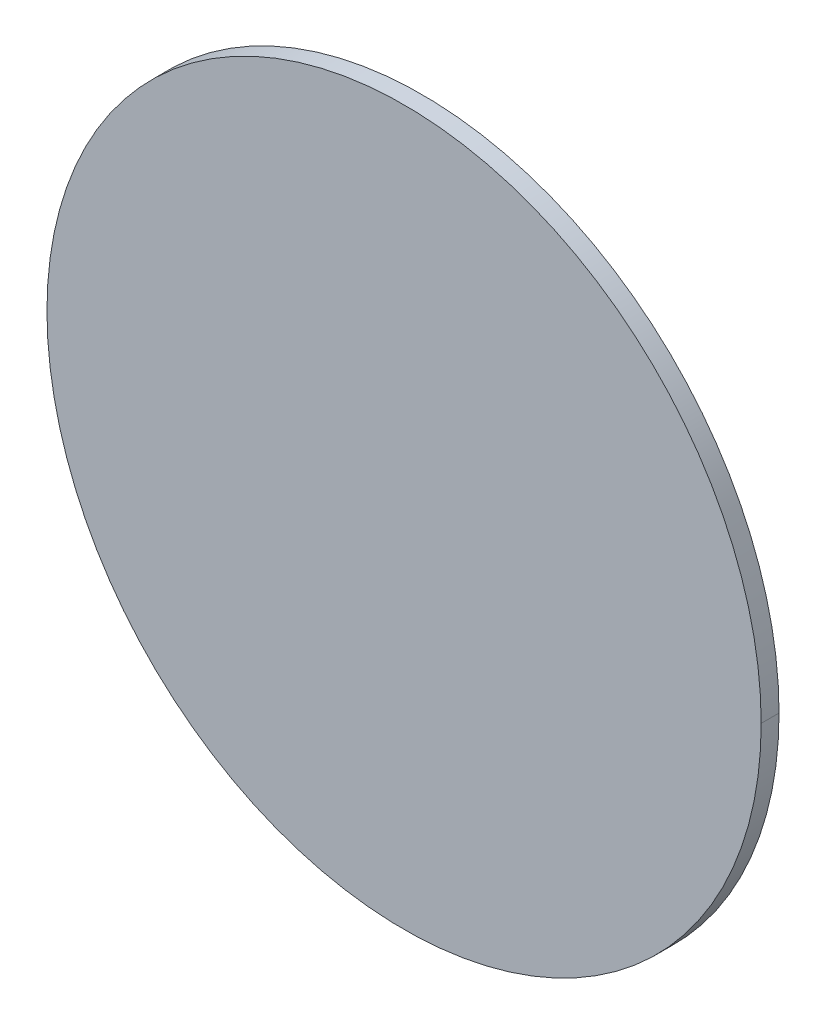
ISO-10303-21;
HEADER;
FILE_DESCRIPTION(('STEP AP214'),'2;1');
FILE_NAME('part.step','',(''),(''),'','','');
FILE_SCHEMA(('AUTOMOTIVE_DESIGN { 1 0 10303 214 1 1 1 1 }'));
ENDSEC;
DATA;
#1=APPLICATION_CONTEXT('core data for automotive mechanical design processes');
#2=APPLICATION_PROTOCOL_DEFINITION('international standard','automotive_design',2000,#1);
#3=PRODUCT_CONTEXT('',#1,'mechanical');
#4=PRODUCT('Part','Part','',(#3));
#5=PRODUCT_RELATED_PRODUCT_CATEGORY('part','',(#4));
#6=PRODUCT_DEFINITION_FORMATION('','',#4);
#7=PRODUCT_DEFINITION_CONTEXT('part definition',#1,'design');
#8=PRODUCT_DEFINITION('design','',#6,#7);
#9=PRODUCT_DEFINITION_SHAPE('','',#8);
#10=(LENGTH_UNIT() NAMED_UNIT(*) SI_UNIT(.MILLI.,.METRE.));
#11=(NAMED_UNIT(*) PLANE_ANGLE_UNIT() SI_UNIT($,.RADIAN.));
#12=(NAMED_UNIT(*) SI_UNIT($,.STERADIAN.) SOLID_ANGLE_UNIT());
#13=UNCERTAINTY_MEASURE_WITH_UNIT(LENGTH_MEASURE(1.E-05),#10,'distance_accuracy_value','');
#14=(GEOMETRIC_REPRESENTATION_CONTEXT(3) GLOBAL_UNCERTAINTY_ASSIGNED_CONTEXT((#13)) GLOBAL_UNIT_ASSIGNED_CONTEXT((#10,
#11,#12)) REPRESENTATION_CONTEXT('',''));
#15=CARTESIAN_POINT('',(0.,0.,0.));
#16=DIRECTION('',(0.,0.,1.));
#17=DIRECTION('',(1.,0.,0.));
#18=AXIS2_PLACEMENT_3D('',#15,#16,#17);
#19=CARTESIAN_POINT('',(0.1999996,0.,0.00999998));
#20=DIRECTION('',(0.,0.,-1.));
#21=DIRECTION('',(0.,-1.,0.));
#22=AXIS2_PLACEMENT_3D('',#19,#20,#21);
#23=PLANE('',#22);
#24=CARTESIAN_POINT('',(0.,0.,0.00999998));
#25=DIRECTION('',(0.,0.,-1.));
#26=DIRECTION('',(-1.,0.,0.));
#27=AXIS2_PLACEMENT_3D('',#24,#25,#26);
#28=CIRCLE('',#27,0.1999996);
#29=CARTESIAN_POINT('',(-0.1999996,0.,0.00999998));
#30=VERTEX_POINT('',#29);
#31=CARTESIAN_POINT('',(0.1999996,0.,0.00999998));
#32=VERTEX_POINT('',#31);
#33=EDGE_CURVE('E64',#30,#32,#28,.T.);
#34=ORIENTED_EDGE('',*,*,#33,.F.);
#35=CARTESIAN_POINT('',(0.,0.,0.00999998));
#36=DIRECTION('',(0.,0.,-1.));
#37=DIRECTION('',(-1.,0.,0.));
#38=AXIS2_PLACEMENT_3D('',#35,#36,#37);
#39=CIRCLE('',#38,0.1999996);
#40=EDGE_CURVE('E11',#32,#30,#39,.T.);
#41=ORIENTED_EDGE('',*,*,#40,.F.);
#42=EDGE_LOOP('',(#34,#41));
#43=FACE_BOUND('',#42,.T.);
#44=ADVANCED_FACE('F16',(#43),#23,.F.);
#45=CARTESIAN_POINT('',(0.,0.,0.));
#46=DIRECTION('',(0.,0.,-1.));
#47=DIRECTION('',(-1.,0.,0.));
#48=AXIS2_PLACEMENT_3D('',#45,#46,#47);
#49=CYLINDRICAL_SURFACE('',#48,0.1999996);
#50=DIRECTION('',(0.,0.,-1.));
#51=VECTOR('',#50,1.);
#52=CARTESIAN_POINT('',(0.1999996,0.,0.));
#53=LINE('',#52,#51);
#54=CARTESIAN_POINT('',(0.1999996,0.,0.));
#55=VERTEX_POINT('',#54);
#56=EDGE_CURVE('E58',#32,#55,#53,.T.);
#57=ORIENTED_EDGE('',*,*,#56,.F.);
#58=ORIENTED_EDGE('',*,*,#40,.T.);
#59=DIRECTION('',(0.,0.,-1.));
#60=VECTOR('',#59,1.);
#61=CARTESIAN_POINT('',(-0.1999996,0.,0.));
#62=LINE('',#61,#60);
#63=CARTESIAN_POINT('',(-0.1999996,0.,0.));
#64=VERTEX_POINT('',#63);
#65=EDGE_CURVE('E55',#30,#64,#62,.T.);
#66=ORIENTED_EDGE('',*,*,#65,.T.);
#67=CARTESIAN_POINT('',(0.,0.,0.));
#68=DIRECTION('',(0.,0.,-1.));
#69=DIRECTION('',(-1.,0.,0.));
#70=AXIS2_PLACEMENT_3D('',#67,#68,#69);
#71=CIRCLE('',#70,0.1999996);
#72=EDGE_CURVE('E20',#55,#64,#71,.T.);
#73=ORIENTED_EDGE('',*,*,#72,.F.);
#74=EDGE_LOOP('',(#57,#58,#66,#73));
#75=FACE_BOUND('',#74,.T.);
#76=ADVANCED_FACE('F54',(#75),#49,.T.);
#77=CARTESIAN_POINT('',(0.1999996,0.,0.));
#78=DIRECTION('',(0.,0.,-1.));
#79=DIRECTION('',(0.,-1.,0.));
#80=AXIS2_PLACEMENT_3D('',#77,#78,#79);
#81=PLANE('',#80);
#82=CARTESIAN_POINT('',(0.,0.,0.));
#83=DIRECTION('',(0.,0.,-1.));
#84=DIRECTION('',(-1.,0.,0.));
#85=AXIS2_PLACEMENT_3D('',#82,#83,#84);
#86=CIRCLE('',#85,0.1999996);
#87=EDGE_CURVE('E65',#64,#55,#86,.T.);
#88=ORIENTED_EDGE('',*,*,#87,.T.);
#89=ORIENTED_EDGE('',*,*,#72,.T.);
#90=EDGE_LOOP('',(#88,#89));
#91=FACE_BOUND('',#90,.T.);
#92=ADVANCED_FACE('F18',(#91),#81,.T.);
#93=CARTESIAN_POINT('',(0.,0.,0.));
#94=DIRECTION('',(0.,0.,-1.));
#95=DIRECTION('',(-1.,0.,0.));
#96=AXIS2_PLACEMENT_3D('',#93,#94,#95);
#97=CYLINDRICAL_SURFACE('',#96,0.1999996);
#98=ORIENTED_EDGE('',*,*,#33,.T.);
#99=ORIENTED_EDGE('',*,*,#56,.T.);
#100=ORIENTED_EDGE('',*,*,#87,.F.);
#101=ORIENTED_EDGE('',*,*,#65,.F.);
#102=EDGE_LOOP('',(#98,#99,#100,#101));
#103=FACE_BOUND('',#102,.T.);
#104=ADVANCED_FACE('F63',(#103),#97,.T.);
#105=CLOSED_SHELL('',(#44,#76,#92,#104));
#106=MANIFOLD_SOLID_BREP('B1',#105);
#107=ADVANCED_BREP_SHAPE_REPRESENTATION('',(#18,#106),#14);
#108=SHAPE_DEFINITION_REPRESENTATION(#9,#107);
ENDSEC;
END-ISO-10303-21;
